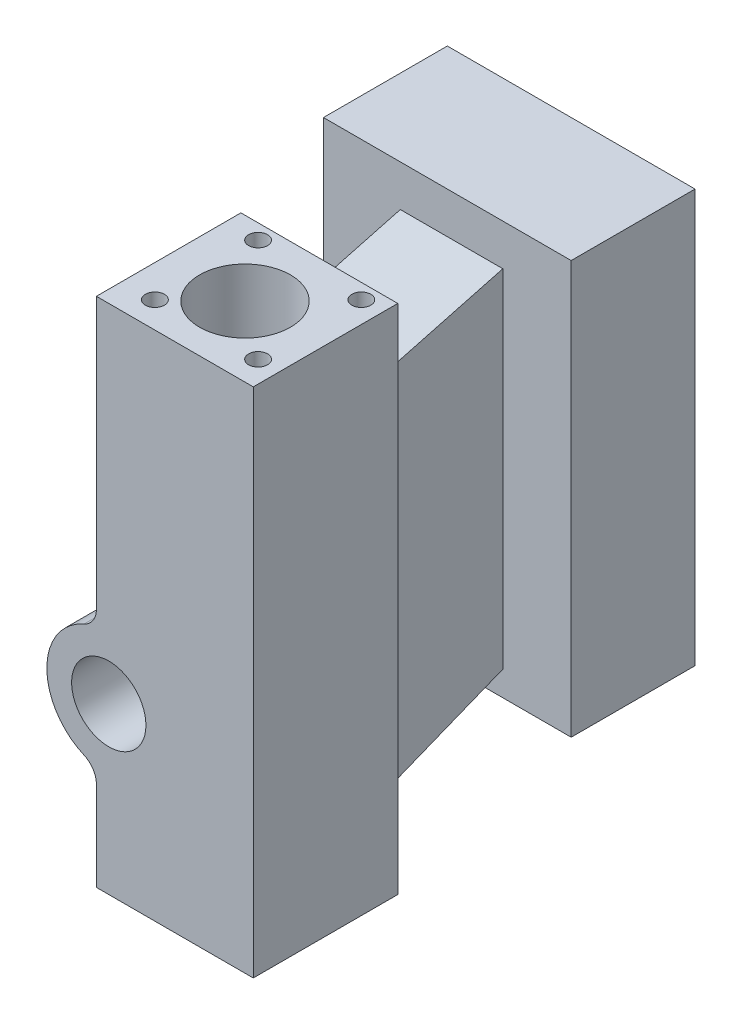
ISO-10303-21;
HEADER;
FILE_DESCRIPTION(('STEP AP214'),'2;1');
FILE_NAME('part.step','',(''),(''),'','','');
FILE_SCHEMA(('AUTOMOTIVE_DESIGN { 1 0 10303 214 1 1 1 1 }'));
ENDSEC;
DATA;
#1=APPLICATION_CONTEXT('core data for automotive mechanical design processes');
#2=APPLICATION_PROTOCOL_DEFINITION('international standard','automotive_design',2000,#1);
#3=PRODUCT_CONTEXT('',#1,'mechanical');
#4=PRODUCT('Part','Part','',(#3));
#5=PRODUCT_RELATED_PRODUCT_CATEGORY('part','',(#4));
#6=PRODUCT_DEFINITION_FORMATION('','',#4);
#7=PRODUCT_DEFINITION_CONTEXT('part definition',#1,'design');
#8=PRODUCT_DEFINITION('design','',#6,#7);
#9=PRODUCT_DEFINITION_SHAPE('','',#8);
#10=(LENGTH_UNIT() NAMED_UNIT(*) SI_UNIT(.MILLI.,.METRE.));
#11=(NAMED_UNIT(*) PLANE_ANGLE_UNIT() SI_UNIT($,.RADIAN.));
#12=(NAMED_UNIT(*) SI_UNIT($,.STERADIAN.) SOLID_ANGLE_UNIT());
#13=UNCERTAINTY_MEASURE_WITH_UNIT(LENGTH_MEASURE(1.E-05),#10,'distance_accuracy_value','');
#14=(GEOMETRIC_REPRESENTATION_CONTEXT(3) GLOBAL_UNCERTAINTY_ASSIGNED_CONTEXT((#13)) GLOBAL_UNIT_ASSIGNED_CONTEXT((#10,
#11,#12)) REPRESENTATION_CONTEXT('',''));
#15=CARTESIAN_POINT('',(0.,0.,0.));
#16=DIRECTION('',(0.,0.,1.));
#17=DIRECTION('',(1.,0.,0.));
#18=AXIS2_PLACEMENT_3D('',#15,#16,#17);
#19=CARTESIAN_POINT('',(0.,0.,0.));
#20=DIRECTION('',(0.,0.,1.));
#21=DIRECTION('',(1.,0.,0.));
#22=AXIS2_PLACEMENT_3D('',#19,#20,#21);
#23=PLANE('',#22);
#24=DIRECTION('',(1.,0.,0.));
#25=VECTOR('',#24,1.);
#26=CARTESIAN_POINT('',(-92.7381953480097,31.309375,0.));
#27=LINE('',#26,#25);
#28=CARTESIAN_POINT('',(-17.5691022526914,31.309375,0.));
#29=VERTEX_POINT('',#28);
#30=CARTESIAN_POINT('',(7.26180465199033,31.309375,0.));
#31=VERTEX_POINT('',#30);
#32=EDGE_CURVE('E349',#29,#31,#27,.T.);
#33=ORIENTED_EDGE('',*,*,#32,.F.);
#34=DIRECTION('',(0.,1.,0.));
#35=VECTOR('',#34,1.);
#36=CARTESIAN_POINT('',(-17.5691022526914,48.6909487492889,0.));
#37=LINE('',#36,#35);
#38=CARTESIAN_POINT('',(-17.5691022526914,-56.690625,0.));
#39=VERTEX_POINT('',#38);
#40=EDGE_CURVE('E273',#39,#29,#37,.T.);
#41=ORIENTED_EDGE('',*,*,#40,.F.);
#42=DIRECTION('',(1.,0.,0.));
#43=VECTOR('',#42,1.);
#44=CARTESIAN_POINT('',(-92.7381953480097,-56.690625,0.));
#45=LINE('',#44,#43);
#46=CARTESIAN_POINT('',(7.26180465199033,-56.690625,0.));
#47=VERTEX_POINT('',#46);
#48=EDGE_CURVE('E338',#39,#47,#45,.T.);
#49=ORIENTED_EDGE('',*,*,#48,.T.);
#50=DIRECTION('',(0.,-1.,0.));
#51=VECTOR('',#50,1.);
#52=CARTESIAN_POINT('',(7.26180465199033,48.6909487492889,0.));
#53=LINE('',#52,#51);
#54=EDGE_CURVE('E278',#31,#47,#53,.T.);
#55=ORIENTED_EDGE('',*,*,#54,.F.);
#56=EDGE_LOOP('',(#33,#41,#49,#55));
#57=FACE_BOUND('',#56,.T.);
#58=DIRECTION('',(0.,-1.,0.));
#59=VECTOR('',#58,1.);
#60=CARTESIAN_POINT('',(-26.18125,49.309375,0.));
#61=LINE('',#60,#59);
#62=CARTESIAN_POINT('',(-26.18125,49.309375,0.));
#63=VERTEX_POINT('',#62);
#64=CARTESIAN_POINT('',(-26.18125,-74.690625,0.));
#65=VERTEX_POINT('',#64);
#66=EDGE_CURVE('E255',#63,#65,#61,.T.);
#67=ORIENTED_EDGE('',*,*,#66,.F.);
#68=DIRECTION('',(-1.,0.,0.));
#69=VECTOR('',#68,1.);
#70=CARTESIAN_POINT('',(-26.18125,49.309375,0.));
#71=LINE('',#70,#69);
#72=CARTESIAN_POINT('',(11.81875,49.309375,0.));
#73=VERTEX_POINT('',#72);
#74=EDGE_CURVE('E245',#73,#63,#71,.T.);
#75=ORIENTED_EDGE('',*,*,#74,.F.);
#76=DIRECTION('',(0.,1.,0.));
#77=VECTOR('',#76,1.);
#78=CARTESIAN_POINT('',(11.81875,49.309375,0.));
#79=LINE('',#78,#77);
#80=CARTESIAN_POINT('',(11.81875,-74.690625,0.));
#81=VERTEX_POINT('',#80);
#82=EDGE_CURVE('E249',#81,#73,#79,.T.);
#83=ORIENTED_EDGE('',*,*,#82,.F.);
#84=DIRECTION('',(1.,0.,0.));
#85=VECTOR('',#84,1.);
#86=CARTESIAN_POINT('',(-26.18125,-74.690625,0.));
#87=LINE('',#86,#85);
#88=EDGE_CURVE('E252',#65,#81,#87,.T.);
#89=ORIENTED_EDGE('',*,*,#88,.F.);
#90=EDGE_LOOP('',(#67,#75,#83,#89));
#91=FACE_BOUND('',#90,.T.);
#92=ADVANCED_FACE('F41',(#57,#91),#23,.F.);
#93=CARTESIAN_POINT('',(-26.18125,49.309375,35.));
#94=DIRECTION('',(1.,0.,0.));
#95=DIRECTION('',(0.,1.,0.));
#96=AXIS2_PLACEMENT_3D('',#93,#94,#95);
#97=PLANE('',#96);
#98=DIRECTION('',(0.,-1.,0.));
#99=VECTOR('',#98,1.);
#100=CARTESIAN_POINT('',(-26.18125,49.309375,35.));
#101=LINE('',#100,#99);
#102=CARTESIAN_POINT('',(-26.18125,-53.0209277798234,35.));
#103=VERTEX_POINT('',#102);
#104=CARTESIAN_POINT('',(-26.18125,-74.690625,35.));
#105=VERTEX_POINT('',#104);
#106=EDGE_CURVE('E248',#103,#105,#101,.T.);
#107=ORIENTED_EDGE('',*,*,#106,.F.);
#108=DIRECTION('',(0.,0.,1.));
#109=VECTOR('',#108,1.);
#110=CARTESIAN_POINT('',(-26.18125,-53.0209277798234,35.));
#111=LINE('',#110,#109);
#112=CARTESIAN_POINT('',(-26.18125,-53.0209277798234,1.));
#113=VERTEX_POINT('',#112);
#114=EDGE_CURVE('E217',#103,#113,#111,.F.);
#115=ORIENTED_EDGE('',*,*,#114,.T.);
#116=DIRECTION('',(0.,-1.,0.));
#117=VECTOR('',#116,1.);
#118=CARTESIAN_POINT('',(-26.18125,49.309375,1.));
#119=LINE('',#118,#117);
#120=CARTESIAN_POINT('',(-26.18125,-16.3603222201766,1.));
#121=VERTEX_POINT('',#120);
#122=EDGE_CURVE('E225',#121,#113,#119,.T.);
#123=ORIENTED_EDGE('',*,*,#122,.F.);
#124=DIRECTION('',(0.,0.,1.));
#125=VECTOR('',#124,1.);
#126=CARTESIAN_POINT('',(-26.18125,-16.3603222201766,35.));
#127=LINE('',#126,#125);
#128=CARTESIAN_POINT('',(-26.18125,-16.3603222201766,35.));
#129=VERTEX_POINT('',#128);
#130=EDGE_CURVE('E221',#121,#129,#127,.T.);
#131=ORIENTED_EDGE('',*,*,#130,.T.);
#132=CARTESIAN_POINT('',(-26.18125,49.309375,35.));
#133=VERTEX_POINT('',#132);
#134=EDGE_CURVE('E266',#133,#129,#101,.T.);
#135=ORIENTED_EDGE('',*,*,#134,.F.);
#136=DIRECTION('',(0.,0.,-1.));
#137=VECTOR('',#136,1.);
#138=CARTESIAN_POINT('',(-26.18125,49.309375,35.));
#139=LINE('',#138,#137);
#140=EDGE_CURVE('E240',#133,#63,#139,.T.);
#141=ORIENTED_EDGE('',*,*,#140,.T.);
#142=ORIENTED_EDGE('',*,*,#66,.T.);
#143=DIRECTION('',(0.,0.,-1.));
#144=VECTOR('',#143,1.);
#145=CARTESIAN_POINT('',(-26.18125,-74.690625,35.));
#146=LINE('',#145,#144);
#147=EDGE_CURVE('E228',#105,#65,#146,.T.);
#148=ORIENTED_EDGE('',*,*,#147,.F.);
#149=EDGE_LOOP('',(#107,#115,#123,#131,#135,#141,#142,#148));
#150=FACE_BOUND('',#149,.T.);
#151=ADVANCED_FACE('F411',(#150),#97,.F.);
#152=CARTESIAN_POINT('',(-26.18125,-74.690625,35.));
#153=DIRECTION('',(0.,1.,0.));
#154=DIRECTION('',(0.,0.,1.));
#155=AXIS2_PLACEMENT_3D('',#152,#153,#154);
#156=PLANE('',#155);
#157=CARTESIAN_POINT('',(-7.18124999999999,-74.690625,18.));
#158=DIRECTION('',(0.,-1.,0.));
#159=DIRECTION('',(0.,0.,-1.));
#160=AXIS2_PLACEMENT_3D('',#157,#158,#159);
#161=CIRCLE('',#160,11.);
#162=CARTESIAN_POINT('',(-7.18124999999999,-74.690625,7.));
#163=VERTEX_POINT('',#162);
#164=EDGE_CURVE('E182',#163,#163,#161,.T.);
#165=ORIENTED_EDGE('',*,*,#164,.F.);
#166=EDGE_LOOP('',(#165));
#167=FACE_BOUND('',#166,.T.);
#168=ORIENTED_EDGE('',*,*,#88,.T.);
#169=DIRECTION('',(0.,0.,-1.));
#170=VECTOR('',#169,1.);
#171=CARTESIAN_POINT('',(11.81875,-74.690625,35.));
#172=LINE('',#171,#170);
#173=CARTESIAN_POINT('',(11.81875,-74.690625,35.));
#174=VERTEX_POINT('',#173);
#175=EDGE_CURVE('E232',#174,#81,#172,.T.);
#176=ORIENTED_EDGE('',*,*,#175,.F.);
#177=DIRECTION('',(1.,0.,0.));
#178=VECTOR('',#177,1.);
#179=CARTESIAN_POINT('',(-26.18125,-74.690625,35.));
#180=LINE('',#179,#178);
#181=EDGE_CURVE('E263',#105,#174,#180,.T.);
#182=ORIENTED_EDGE('',*,*,#181,.F.);
#183=ORIENTED_EDGE('',*,*,#147,.T.);
#184=EDGE_LOOP('',(#168,#176,#182,#183));
#185=FACE_BOUND('',#184,.T.);
#186=ADVANCED_FACE('F432',(#167,#185),#156,.F.);
#187=CARTESIAN_POINT('',(11.81875,49.309375,35.));
#188=DIRECTION('',(-1.,0.,0.));
#189=DIRECTION('',(0.,0.,1.));
#190=AXIS2_PLACEMENT_3D('',#187,#188,#189);
#191=PLANE('',#190);
#192=ORIENTED_EDGE('',*,*,#82,.T.);
#193=DIRECTION('',(0.,0.,-1.));
#194=VECTOR('',#193,1.);
#195=CARTESIAN_POINT('',(11.81875,49.309375,35.));
#196=LINE('',#195,#194);
#197=CARTESIAN_POINT('',(11.81875,49.309375,35.));
#198=VERTEX_POINT('',#197);
#199=EDGE_CURVE('E236',#198,#73,#196,.T.);
#200=ORIENTED_EDGE('',*,*,#199,.F.);
#201=DIRECTION('',(0.,1.,0.));
#202=VECTOR('',#201,1.);
#203=CARTESIAN_POINT('',(11.81875,49.309375,35.));
#204=LINE('',#203,#202);
#205=EDGE_CURVE('E260',#174,#198,#204,.T.);
#206=ORIENTED_EDGE('',*,*,#205,.F.);
#207=ORIENTED_EDGE('',*,*,#175,.T.);
#208=EDGE_LOOP('',(#192,#200,#206,#207));
#209=FACE_BOUND('',#208,.T.);
#210=ADVANCED_FACE('F438',(#209),#191,.F.);
#211=CARTESIAN_POINT('',(-26.18125,49.309375,35.));
#212=DIRECTION('',(0.,-1.,0.));
#213=DIRECTION('',(0.,0.,-1.));
#214=AXIS2_PLACEMENT_3D('',#211,#212,#213);
#215=PLANE('',#214);
#216=CARTESIAN_POINT('',(6.62471597335038,49.309375,3.63901541292802));
#217=DIRECTION('',(0.,1.,0.));
#218=DIRECTION('',(0.,0.,1.));
#219=AXIS2_PLACEMENT_3D('',#216,#217,#218);
#220=CIRCLE('',#219,2.30151664549466);
#221=CARTESIAN_POINT('',(6.62471597335038,49.309375,5.94053205842269));
#222=VERTEX_POINT('',#221);
#223=EDGE_CURVE('E387',#222,#222,#220,.T.);
#224=ORIENTED_EDGE('',*,*,#223,.F.);
#225=EDGE_LOOP('',(#224));
#226=FACE_BOUND('',#225,.T.);
#227=CARTESIAN_POINT('',(-18.3752840266496,49.309375,28.639015412928));
#228=DIRECTION('',(0.,1.,0.));
#229=DIRECTION('',(0.,0.,1.));
#230=AXIS2_PLACEMENT_3D('',#227,#228,#229);
#231=CIRCLE('',#230,2.30151664549466);
#232=CARTESIAN_POINT('',(-18.3752840266496,49.309375,30.9405320584227));
#233=VERTEX_POINT('',#232);
#234=EDGE_CURVE('E379',#233,#233,#231,.T.);
#235=ORIENTED_EDGE('',*,*,#234,.F.);
#236=EDGE_LOOP('',(#235));
#237=FACE_BOUND('',#236,.T.);
#238=CARTESIAN_POINT('',(-18.3752840266496,49.309375,3.63901541292802));
#239=DIRECTION('',(0.,1.,0.));
#240=DIRECTION('',(0.,0.,1.));
#241=AXIS2_PLACEMENT_3D('',#238,#239,#240);
#242=CIRCLE('',#241,2.30151664549466);
#243=CARTESIAN_POINT('',(-18.3752840266496,49.309375,5.94053205842269));
#244=VERTEX_POINT('',#243);
#245=EDGE_CURVE('E172',#244,#244,#242,.T.);
#246=ORIENTED_EDGE('',*,*,#245,.F.);
#247=EDGE_LOOP('',(#246));
#248=FACE_BOUND('',#247,.T.);
#249=CARTESIAN_POINT('',(6.62471597335038,49.309375,28.639015412928));
#250=DIRECTION('',(0.,1.,0.));
#251=DIRECTION('',(0.,0.,1.));
#252=AXIS2_PLACEMENT_3D('',#249,#250,#251);
#253=CIRCLE('',#252,2.30151664549466);
#254=CARTESIAN_POINT('',(6.62471597335038,49.309375,30.9405320584227));
#255=VERTEX_POINT('',#254);
#256=EDGE_CURVE('E364',#255,#255,#253,.T.);
#257=ORIENTED_EDGE('',*,*,#256,.F.);
#258=EDGE_LOOP('',(#257));
#259=FACE_BOUND('',#258,.T.);
#260=CARTESIAN_POINT('',(-7.18124999999999,49.309375,18.));
#261=DIRECTION('',(0.,-1.,0.));
#262=DIRECTION('',(0.,0.,-1.));
#263=AXIS2_PLACEMENT_3D('',#260,#261,#262);
#264=CIRCLE('',#263,11.);
#265=CARTESIAN_POINT('',(-7.18124999999999,49.309375,7.));
#266=VERTEX_POINT('',#265);
#267=EDGE_CURVE('E185',#266,#266,#264,.T.);
#268=ORIENTED_EDGE('',*,*,#267,.T.);
#269=EDGE_LOOP('',(#268));
#270=FACE_BOUND('',#269,.T.);
#271=ORIENTED_EDGE('',*,*,#74,.T.);
#272=ORIENTED_EDGE('',*,*,#140,.F.);
#273=DIRECTION('',(-1.,0.,0.));
#274=VECTOR('',#273,1.);
#275=CARTESIAN_POINT('',(-26.18125,49.309375,35.));
#276=LINE('',#275,#274);
#277=EDGE_CURVE('E244',#198,#133,#276,.T.);
#278=ORIENTED_EDGE('',*,*,#277,.F.);
#279=ORIENTED_EDGE('',*,*,#199,.T.);
#280=EDGE_LOOP('',(#271,#272,#278,#279));
#281=FACE_BOUND('',#280,.T.);
#282=ADVANCED_FACE('F403',(#226,#237,#248,#259,#270,#281),#215,.F.);
#283=CARTESIAN_POINT('',(0.,0.,35.));
#284=DIRECTION('',(0.,0.,1.));
#285=DIRECTION('',(1.,0.,0.));
#286=AXIS2_PLACEMENT_3D('',#283,#284,#285);
#287=PLANE('',#286);
#288=CARTESIAN_POINT('',(-23.18125,-34.690625,35.));
#289=DIRECTION('',(0.,0.,1.));
#290=DIRECTION('',(1.,0.,0.));
#291=AXIS2_PLACEMENT_3D('',#288,#289,#290);
#292=CIRCLE('',#291,9.);
#293=CARTESIAN_POINT('',(-14.18125,-34.690625,35.));
#294=VERTEX_POINT('',#293);
#295=EDGE_CURVE('E173',#294,#294,#292,.T.);
#296=ORIENTED_EDGE('',*,*,#295,.F.);
#297=EDGE_LOOP('',(#296));
#298=FACE_BOUND('',#297,.T.);
#299=ORIENTED_EDGE('',*,*,#134,.T.);
#300=CARTESIAN_POINT('',(-31.18125,-16.3603222201766,35.));
#301=DIRECTION('',(0.,0.,1.));
#302=DIRECTION('',(1.,0.,0.));
#303=AXIS2_PLACEMENT_3D('',#300,#301,#302);
#304=CIRCLE('',#303,5.);
#305=CARTESIAN_POINT('',(-29.18125,-20.9428979151325,35.));
#306=VERTEX_POINT('',#305);
#307=EDGE_CURVE('E202',#129,#306,#304,.F.);
#308=ORIENTED_EDGE('',*,*,#307,.T.);
#309=CARTESIAN_POINT('',(-23.18125,-34.690625,35.));
#310=DIRECTION('',(0.,0.,1.));
#311=DIRECTION('',(1.,0.,0.));
#312=AXIS2_PLACEMENT_3D('',#309,#310,#311);
#313=CIRCLE('',#312,15.);
#314=CARTESIAN_POINT('',(-29.18125,-48.4383520848675,35.));
#315=VERTEX_POINT('',#314);
#316=EDGE_CURVE('E188',#306,#315,#313,.T.);
#317=ORIENTED_EDGE('',*,*,#316,.T.);
#318=CARTESIAN_POINT('',(-31.18125,-53.0209277798234,35.));
#319=DIRECTION('',(0.,0.,1.));
#320=DIRECTION('',(1.,0.,0.));
#321=AXIS2_PLACEMENT_3D('',#318,#319,#320);
#322=CIRCLE('',#321,5.);
#323=EDGE_CURVE('E205',#315,#103,#322,.F.);
#324=ORIENTED_EDGE('',*,*,#323,.T.);
#325=ORIENTED_EDGE('',*,*,#106,.T.);
#326=ORIENTED_EDGE('',*,*,#181,.T.);
#327=ORIENTED_EDGE('',*,*,#205,.T.);
#328=ORIENTED_EDGE('',*,*,#277,.T.);
#329=EDGE_LOOP('',(#299,#308,#317,#324,#325,#326,#327,#328));
#330=FACE_BOUND('',#329,.T.);
#331=ADVANCED_FACE('F399',(#298,#330),#287,.T.);
#332=CARTESIAN_POINT('',(-23.18125,-34.690625,1.));
#333=DIRECTION('',(0.,0.,1.));
#334=DIRECTION('',(1.,0.,0.));
#335=AXIS2_PLACEMENT_3D('',#332,#333,#334);
#336=PLANE('',#335);
#337=CARTESIAN_POINT('',(-23.18125,-34.690625,1.));
#338=DIRECTION('',(0.,0.,1.));
#339=DIRECTION('',(1.,0.,0.));
#340=AXIS2_PLACEMENT_3D('',#337,#338,#339);
#341=CIRCLE('',#340,15.);
#342=CARTESIAN_POINT('',(-29.18125,-20.9428979151325,1.));
#343=VERTEX_POINT('',#342);
#344=CARTESIAN_POINT('',(-29.18125,-48.4383520848675,1.));
#345=VERTEX_POINT('',#344);
#346=EDGE_CURVE('E193',#343,#345,#341,.T.);
#347=ORIENTED_EDGE('',*,*,#346,.F.);
#348=CARTESIAN_POINT('',(-31.18125,-16.3603222201766,1.));
#349=DIRECTION('',(0.,0.,1.));
#350=DIRECTION('',(1.,0.,0.));
#351=AXIS2_PLACEMENT_3D('',#348,#349,#350);
#352=CIRCLE('',#351,5.);
#353=EDGE_CURVE('E198',#343,#121,#352,.T.);
#354=ORIENTED_EDGE('',*,*,#353,.T.);
#355=ORIENTED_EDGE('',*,*,#122,.T.);
#356=CARTESIAN_POINT('',(-31.18125,-53.0209277798234,1.));
#357=DIRECTION('',(0.,0.,1.));
#358=DIRECTION('',(1.,0.,0.));
#359=AXIS2_PLACEMENT_3D('',#356,#357,#358);
#360=CIRCLE('',#359,5.);
#361=EDGE_CURVE('E208',#113,#345,#360,.T.);
#362=ORIENTED_EDGE('',*,*,#361,.T.);
#363=EDGE_LOOP('',(#347,#354,#355,#362));
#364=FACE_BOUND('',#363,.T.);
#365=ADVANCED_FACE('F402',(#364),#336,.F.);
#366=CARTESIAN_POINT('',(-23.18125,-34.690625,1.));
#367=DIRECTION('',(0.,0.,1.));
#368=DIRECTION('',(1.,0.,0.));
#369=AXIS2_PLACEMENT_3D('',#366,#367,#368);
#370=CYLINDRICAL_SURFACE('',#369,15.);
#371=ORIENTED_EDGE('',*,*,#346,.T.);
#372=DIRECTION('',(0.,0.,1.));
#373=VECTOR('',#372,1.);
#374=CARTESIAN_POINT('',(-29.18125,-48.4383520848675,1.));
#375=LINE('',#374,#373);
#376=EDGE_CURVE('E211',#345,#315,#375,.T.);
#377=ORIENTED_EDGE('',*,*,#376,.T.);
#378=ORIENTED_EDGE('',*,*,#316,.F.);
#379=DIRECTION('',(0.,0.,1.));
#380=VECTOR('',#379,1.);
#381=CARTESIAN_POINT('',(-29.18125,-20.9428979151325,1.));
#382=LINE('',#381,#380);
#383=EDGE_CURVE('E214',#306,#343,#382,.F.);
#384=ORIENTED_EDGE('',*,*,#383,.T.);
#385=EDGE_LOOP('',(#371,#377,#378,#384));
#386=FACE_BOUND('',#385,.T.);
#387=ADVANCED_FACE('F419',(#386),#370,.T.);
#388=CARTESIAN_POINT('',(-31.18125,-53.0209277798234,1.));
#389=DIRECTION('',(0.,0.,1.));
#390=DIRECTION('',(1.,0.,0.));
#391=AXIS2_PLACEMENT_3D('',#388,#389,#390);
#392=CYLINDRICAL_SURFACE('',#391,5.);
#393=ORIENTED_EDGE('',*,*,#323,.F.);
#394=ORIENTED_EDGE('',*,*,#376,.F.);
#395=ORIENTED_EDGE('',*,*,#361,.F.);
#396=ORIENTED_EDGE('',*,*,#114,.F.);
#397=EDGE_LOOP('',(#393,#394,#395,#396));
#398=FACE_BOUND('',#397,.T.);
#399=ADVANCED_FACE('F426',(#398),#392,.F.);
#400=CARTESIAN_POINT('',(-31.18125,-16.3603222201766,1.));
#401=DIRECTION('',(0.,0.,1.));
#402=DIRECTION('',(1.,0.,0.));
#403=AXIS2_PLACEMENT_3D('',#400,#401,#402);
#404=CYLINDRICAL_SURFACE('',#403,5.);
#405=ORIENTED_EDGE('',*,*,#353,.F.);
#406=ORIENTED_EDGE('',*,*,#383,.F.);
#407=ORIENTED_EDGE('',*,*,#307,.F.);
#408=ORIENTED_EDGE('',*,*,#130,.F.);
#409=EDGE_LOOP('',(#405,#406,#407,#408));
#410=FACE_BOUND('',#409,.T.);
#411=ADVANCED_FACE('F43',(#410),#404,.F.);
#412=CARTESIAN_POINT('',(-7.18124999999999,925.309375,18.));
#413=DIRECTION('',(0.,-1.,0.));
#414=DIRECTION('',(0.,0.,-1.));
#415=AXIS2_PLACEMENT_3D('',#412,#413,#414);
#416=CYLINDRICAL_SURFACE('',#415,11.);
#417=DIRECTION('',(0.,-1.,0.));
#418=VECTOR('',#417,1.);
#419=CARTESIAN_POINT('',(-18.18125,925.309375,18.));
#420=LINE('',#419,#418);
#421=CARTESIAN_POINT('',(-18.18125,-42.1739397735479,18.));
#422=VERTEX_POINT('',#421);
#423=CARTESIAN_POINT('',(-18.18125,-27.2073102264521,18.));
#424=VERTEX_POINT('',#423);
#425=EDGE_CURVE('E56',#422,#424,#420,.F.);
#426=ORIENTED_EDGE('',*,*,#425,.F.);
#427=CARTESIAN_POINT('',(-18.18125,-42.1739397735479,18.));
#428=CARTESIAN_POINT('',(-18.1812506986015,-42.1739364043247,18.1224798590371));
#429=CARTESIAN_POINT('',(-18.1792039506006,-42.1725732075603,18.2449462679007));
#430=CARTESIAN_POINT('',(-18.1710271681398,-42.1671015707938,18.4896830604016));
#431=CARTESIAN_POINT('',(-18.1648970719768,-42.1629930893082,18.6119534410487));
#432=CARTESIAN_POINT('',(-18.1403982580435,-42.1465107181732,18.97822634366));
#433=CARTESIAN_POINT('',(-18.1159210175816,-42.1299798959348,19.221675481537));
#434=CARTESIAN_POINT('',(-18.050841776926,-42.0852494353983,19.7064852840486));
#435=CARTESIAN_POINT('',(-18.0101641455306,-42.0569950395658,19.9478306487566));
#436=CARTESIAN_POINT('',(-17.9132586172202,-41.9880084510938,20.4255673005737));
#437=CARTESIAN_POINT('',(-17.8570318622359,-41.9472771747353,20.6619589501138));
#438=CARTESIAN_POINT('',(-17.7297243346768,-41.8521330937214,21.1286324957773));
#439=CARTESIAN_POINT('',(-17.6586031843799,-41.7976830150952,21.3588958256013));
#440=CARTESIAN_POINT('',(-17.5028552229484,-41.6738710000895,21.8107156819696));
#441=CARTESIAN_POINT('',(-17.4182280049387,-41.6045086144494,22.0322719459597));
#442=CARTESIAN_POINT('',(-17.2373913856752,-41.4496688886427,22.4641570510437));
#443=CARTESIAN_POINT('',(-17.1412082863745,-41.3642279023242,22.6745098727483));
#444=CARTESIAN_POINT('',(-16.9393538337212,-41.1758215085777,23.0824377151739));
#445=CARTESIAN_POINT('',(-16.8336836722432,-41.0728583010425,23.280014335639));
#446=CARTESIAN_POINT('',(-16.6239643898392,-40.8568952281534,23.6458995935318));
#447=CARTESIAN_POINT('',(-16.5204042152415,-40.7452560550955,23.8152912972508));
#448=CARTESIAN_POINT('',(-16.3101935241447,-40.5056030883655,24.1400157205915));
#449=CARTESIAN_POINT('',(-16.2035431424594,-40.3775900081944,24.2953490523102));
#450=CARTESIAN_POINT('',(-15.9901200296433,-40.1051942535036,24.5906751570075));
#451=CARTESIAN_POINT('',(-15.8833473858177,-39.9608197574149,24.7306755261135));
#452=CARTESIAN_POINT('',(-15.6727036469236,-39.6561065270827,24.9945495323188));
#453=CARTESIAN_POINT('',(-15.5688321838721,-39.4957698293528,25.1184252220194));
#454=CARTESIAN_POINT('',(-15.3803654234737,-39.1822953506115,25.3343207498921));
#455=CARTESIAN_POINT('',(-15.2950357492867,-39.0310019706238,25.4283871274128));
#456=CARTESIAN_POINT('',(-15.130720791219,-38.7180558611037,25.6039709482515));
#457=CARTESIAN_POINT('',(-15.0517348964801,-38.5564041317035,25.6854896005152));
#458=CARTESIAN_POINT('',(-14.9017835681919,-38.2238542460231,25.836112869441));
#459=CARTESIAN_POINT('',(-14.8308185738638,-38.0529555841417,25.9052168064005));
#460=CARTESIAN_POINT('',(-14.6983609179581,-37.7031921145686,26.0312769484373));
#461=CARTESIAN_POINT('',(-14.6368683069452,-37.5243272643589,26.0882330886689));
#462=CARTESIAN_POINT('',(-14.5268143971213,-37.1673598246839,26.1882837315232));
#463=CARTESIAN_POINT('',(-14.4778316391461,-36.9895173458749,26.2318445850532));
#464=CARTESIAN_POINT('',(-14.3905154525214,-36.6290211762794,26.3084214392102));
#465=CARTESIAN_POINT('',(-14.3521816416491,-36.4463676584335,26.3414378183167));
#466=CARTESIAN_POINT('',(-14.2867772351565,-36.0775070500731,26.3972216859052));
#467=CARTESIAN_POINT('',(-14.2597071813809,-35.8912997890559,26.4199886813433));
#468=CARTESIAN_POINT('',(-14.2172496831342,-35.5166092224279,26.4554996795944));
#469=CARTESIAN_POINT('',(-14.2018625401564,-35.3281258582068,26.4682434237441));
#470=CARTESIAN_POINT('',(-14.1828054690151,-34.9461933194525,26.4840072970008));
#471=CARTESIAN_POINT('',(-14.1793878311338,-34.7527228515258,26.4868180723491));
#472=CARTESIAN_POINT('',(-14.1850254750878,-34.3660859869477,26.4821660977565));
#473=CARTESIAN_POINT('',(-14.1940809019432,-34.172919593858,26.4747032283673));
#474=CARTESIAN_POINT('',(-14.2245256597734,-33.7882289035702,26.4494176742743));
#475=CARTESIAN_POINT('',(-14.2459158303697,-33.5967047190575,26.4315942843331));
#476=CARTESIAN_POINT('',(-14.300692371015,-33.2166668920691,26.3853933927703));
#477=CARTESIAN_POINT('',(-14.3340787222334,-33.0281532448681,26.3570159077157));
#478=CARTESIAN_POINT('',(-14.4125799206903,-32.6541597335332,26.2891842666575));
#479=CARTESIAN_POINT('',(-14.4577767816589,-32.4687111278791,26.2496524942789));
#480=CARTESIAN_POINT('',(-14.558995571881,-32.1036167044388,26.159256725709));
#481=CARTESIAN_POINT('',(-14.6150175354547,-31.923970905052,26.1083926935895));
#482=CARTESIAN_POINT('',(-14.736836196298,-31.5718807617436,25.9950005733072));
#483=CARTESIAN_POINT('',(-14.8026298677184,-31.3994342096473,25.9324760943224));
#484=CARTESIAN_POINT('',(-14.9427264557856,-31.0629621255557,25.7954522923056));
#485=CARTESIAN_POINT('',(-15.0170291568532,-30.8989363803686,25.7209532726337));
#486=CARTESIAN_POINT('',(-15.1710441853367,-30.5837102519214,25.5614298506296));
#487=CARTESIAN_POINT('',(-15.2506153835243,-30.4323166005309,25.4766509302215));
#488=CARTESIAN_POINT('',(-15.4148608327142,-30.1396516845565,25.2953823251198));
#489=CARTESIAN_POINT('',(-15.4995349844708,-29.9983802232267,25.1988928681435));
#490=CARTESIAN_POINT('',(-15.6722313277923,-29.726700244948,24.9943648990359));
#491=CARTESIAN_POINT('',(-15.7602530901729,-29.5962903422733,24.8863278641813));
#492=CARTESIAN_POINT('',(-15.9378446827229,-29.3467937592537,24.6590421883181));
#493=CARTESIAN_POINT('',(-16.0274145249011,-29.2277071667926,24.5397934603062));
#494=CARTESIAN_POINT('',(-16.2061645687658,-29.0012518555617,24.2908157261268));
#495=CARTESIAN_POINT('',(-16.2953451555223,-28.893865624082,24.1611029032286));
#496=CARTESIAN_POINT('',(-16.4717431636031,-28.6905720424782,23.8917444285983));
#497=CARTESIAN_POINT('',(-16.5589605912921,-28.594664655135,23.7520988090747));
#498=CARTESIAN_POINT('',(-16.7298817711456,-28.4140562590788,23.4636742262679));
#499=CARTESIAN_POINT('',(-16.813584845922,-28.3293574040914,23.314893515689));
#500=CARTESIAN_POINT('',(-16.9760758983979,-28.1707547171116,23.0091282498306));
#501=CARTESIAN_POINT('',(-17.0548636558765,-28.0968513685918,22.8521433275558));
#502=CARTESIAN_POINT('',(-17.2123957736155,-27.9537863582217,22.5180622512513));
#503=CARTESIAN_POINT('',(-17.2906325434569,-27.8854768516386,22.3403618535127));
#504=CARTESIAN_POINT('',(-17.4387526256834,-27.7600300183219,21.9776901124417));
#505=CARTESIAN_POINT('',(-17.5086354125033,-27.7028933943523,21.7927183126233));
#506=CARTESIAN_POINT('',(-17.6391244525208,-27.5989530772792,21.4165099664933));
#507=CARTESIAN_POINT('',(-17.6997222572302,-27.5521587778232,21.2252679046121));
#508=CARTESIAN_POINT('',(-17.8108102309622,-27.4682137724304,20.8377941830714));
#509=CARTESIAN_POINT('',(-17.861299811075,-27.4310636283291,20.6415622334491));
#510=CARTESIAN_POINT('',(-17.9517161607931,-27.3656607784052,20.2446801695225));
#511=CARTESIAN_POINT('',(-17.9916153020802,-27.3374313090085,20.0440199499092));
#512=CARTESIAN_POINT('',(-18.0602713553861,-27.2894548450028,19.6397968783484));
#513=CARTESIAN_POINT('',(-18.0890278161221,-27.2697081939478,19.4362339091845));
#514=CARTESIAN_POINT('',(-18.1350626122585,-27.2383225461031,19.0276784870494));
#515=CARTESIAN_POINT('',(-18.1523673749997,-27.2266648791422,18.8226904362788));
#516=CARTESIAN_POINT('',(-18.1754697102279,-27.2111738558932,18.4118000265114));
#517=CARTESIAN_POINT('',(-18.1812688699207,-27.2073394203828,18.2058977975543));
#518=CARTESIAN_POINT('',(-18.18125,-27.2073102264521,18.));
#519=B_SPLINE_CURVE_WITH_KNOTS('',3,(#427,#428,#429,#430,#431,#432,#433,#434,#435,#436,#437,
#438,#439,#440,#441,#442,#443,#444,#445,#446,#447,#448,#449,#450,#451,#452,#453,#454,#455,#456,
#457,#458,#459,#460,#461,#462,#463,#464,#465,#466,#467,#468,#469,#470,#471,#472,#473,#474,#475,
#476,#477,#478,#479,#480,#481,#482,#483,#484,#485,#486,#487,#488,#489,#490,#491,#492,#493,#494,
#495,#496,#497,#498,#499,#500,#501,#502,#503,#504,#505,#506,#507,#508,#509,#510,#511,#512,#513,
#514,#515,#516,#517,#518),.UNSPECIFIED.,.F.,.F.,(4,2,2,2,2,2,2,2,2,2,2,2,2,2,2,2,2,2,2,2,2,2,2,
2,2,2,2,2,2,2,2,2,2,2,2,2,2,2,2,2,2,2,2,2,2,4),(0.,0.367387865426625,0.734781282530552,
1.46961341812703,2.20791708915194,2.94616655340197,3.68644388860219,4.4267435291361,
5.16538903067794,5.90394186453074,6.5862729865422,7.26857438576624,7.9505362211867,
8.63241116076783,9.22426014369187,9.81605206752715,10.4078763819547,10.9997038554987,
11.5676660732255,12.135607902436,12.7035770494132,13.2715608531078,13.8514467282948,
14.431339345678,15.011271440796,15.591202625584,16.1752731939746,16.7593456141542,
17.3432375495581,17.9271146951198,18.4990910521764,19.07105628865,19.6429484412395,
20.2148450321037,20.7858735145701,21.3569001454789,21.9280363406452,22.4991981060863,
23.116047258306,23.7329351972942,24.3503811567521,24.9678630784234,25.5869403961852,
26.2060427841973,26.8237114266841,27.4412948554336),.UNSPECIFIED.);
#520=EDGE_CURVE('E11',#422,#424,#519,.T.);
#521=ORIENTED_EDGE('',*,*,#520,.T.);
#522=EDGE_LOOP('',(#426,#521));
#523=FACE_BOUND('',#522,.T.);
#524=ORIENTED_EDGE('',*,*,#164,.T.);
#525=EDGE_LOOP('',(#524));
#526=FACE_BOUND('',#525,.T.);
#527=ORIENTED_EDGE('',*,*,#267,.F.);
#528=EDGE_LOOP('',(#527));
#529=FACE_BOUND('',#528,.T.);
#530=ADVANCED_FACE('F175',(#523,#526,#529),#416,.F.);
#531=CARTESIAN_POINT('',(7.26180465199033,48.6909487492889,-30.));
#532=DIRECTION('',(-1.,0.,0.));
#533=DIRECTION('',(0.,0.,1.));
#534=AXIS2_PLACEMENT_3D('',#531,#532,#533);
#535=PLANE('',#534);
#536=DIRECTION('',(0.,-1.,0.));
#537=VECTOR('',#536,1.);
#538=CARTESIAN_POINT('',(7.26180465199033,48.6909487492889,-30.));
#539=LINE('',#538,#537);
#540=CARTESIAN_POINT('',(7.26180465199033,39.309375,-30.));
#541=VERTEX_POINT('',#540);
#542=CARTESIAN_POINT('',(7.26180465199033,-44.690625,-30.));
#543=VERTEX_POINT('',#542);
#544=EDGE_CURVE('E277',#541,#543,#539,.T.);
#545=ORIENTED_EDGE('',*,*,#544,.F.);
#546=DIRECTION('',(0.,0.257662650560332,-0.966234939601246));
#547=VECTOR('',#546,1.);
#548=CARTESIAN_POINT('',(7.26180465199033,31.309375,0.));
#549=LINE('',#548,#547);
#550=EDGE_CURVE('E70',#31,#541,#549,.T.);
#551=ORIENTED_EDGE('',*,*,#550,.F.);
#552=ORIENTED_EDGE('',*,*,#54,.T.);
#553=DIRECTION('',(0.,-0.371390676354103,0.928476690885259));
#554=VECTOR('',#553,1.);
#555=CARTESIAN_POINT('',(7.26180465199033,-44.690625,-30.));
#556=LINE('',#555,#554);
#557=EDGE_CURVE('E342',#543,#47,#556,.T.);
#558=ORIENTED_EDGE('',*,*,#557,.F.);
#559=EDGE_LOOP('',(#545,#551,#552,#558));
#560=FACE_BOUND('',#559,.T.);
#561=ADVANCED_FACE('F178',(#560),#535,.F.);
#562=CARTESIAN_POINT('',(-17.5691022526914,48.6909487492889,-30.));
#563=DIRECTION('',(1.,0.,0.));
#564=DIRECTION('',(0.,0.,-1.));
#565=AXIS2_PLACEMENT_3D('',#562,#563,#564);
#566=PLANE('',#565);
#567=ORIENTED_EDGE('',*,*,#40,.T.);
#568=DIRECTION('',(0.,0.257662650560332,-0.966234939601246));
#569=VECTOR('',#568,1.);
#570=CARTESIAN_POINT('',(-17.5691022526914,39.9322180704922,-32.3356615143458));
#571=LINE('',#570,#569);
#572=CARTESIAN_POINT('',(-17.5691022526914,39.309375,-30.));
#573=VERTEX_POINT('',#572);
#574=EDGE_CURVE('E318',#29,#573,#571,.T.);
#575=ORIENTED_EDGE('',*,*,#574,.T.);
#576=DIRECTION('',(0.,1.,0.));
#577=VECTOR('',#576,1.);
#578=CARTESIAN_POINT('',(-17.5691022526914,48.6909487492889,-30.));
#579=LINE('',#578,#577);
#580=CARTESIAN_POINT('',(-17.5691022526914,-44.690625,-30.));
#581=VERTEX_POINT('',#580);
#582=EDGE_CURVE('E195',#581,#573,#579,.T.);
#583=ORIENTED_EDGE('',*,*,#582,.F.);
#584=DIRECTION('',(0.,-0.371390676354103,0.92847669088526));
#585=VECTOR('',#584,1.);
#586=CARTESIAN_POINT('',(-17.5691022526914,-31.8104079311326,-62.2005426721685));
#587=LINE('',#586,#585);
#588=EDGE_CURVE('E333',#581,#39,#587,.T.);
#589=ORIENTED_EDGE('',*,*,#588,.T.);
#590=EDGE_LOOP('',(#567,#575,#583,#589));
#591=FACE_BOUND('',#590,.T.);
#592=ADVANCED_FACE('F472',(#591),#566,.F.);
#593=CARTESIAN_POINT('',(0.,0.,-30.));
#594=DIRECTION('',(0.,0.,-1.));
#595=DIRECTION('',(-1.,0.,0.));
#596=AXIS2_PLACEMENT_3D('',#593,#594,#595);
#597=PLANE('',#596);
#598=DIRECTION('',(1.,0.,0.));
#599=VECTOR('',#598,1.);
#600=CARTESIAN_POINT('',(-92.7381953480097,-44.690625,-30.));
#601=LINE('',#600,#599);
#602=EDGE_CURVE('E341',#581,#543,#601,.T.);
#603=ORIENTED_EDGE('',*,*,#602,.F.);
#604=ORIENTED_EDGE('',*,*,#582,.T.);
#605=DIRECTION('',(1.,0.,0.));
#606=VECTOR('',#605,1.);
#607=CARTESIAN_POINT('',(-92.7381953480097,39.309375,-30.));
#608=LINE('',#607,#606);
#609=EDGE_CURVE('E337',#573,#541,#608,.T.);
#610=ORIENTED_EDGE('',*,*,#609,.T.);
#611=ORIENTED_EDGE('',*,*,#544,.T.);
#612=EDGE_LOOP('',(#603,#604,#610,#611));
#613=FACE_BOUND('',#612,.T.);
#614=DIRECTION('',(0.,-1.,0.));
#615=VECTOR('',#614,1.);
#616=CARTESIAN_POINT('',(23.81875,49.309375,-30.));
#617=LINE('',#616,#615);
#618=CARTESIAN_POINT('',(23.81875,49.309375,-30.));
#619=VERTEX_POINT('',#618);
#620=CARTESIAN_POINT('',(23.81875,-50.690625,-30.));
#621=VERTEX_POINT('',#620);
#622=EDGE_CURVE('E312',#619,#621,#617,.T.);
#623=ORIENTED_EDGE('',*,*,#622,.F.);
#624=DIRECTION('',(1.,0.,0.));
#625=VECTOR('',#624,1.);
#626=CARTESIAN_POINT('',(23.81875,49.309375,-30.));
#627=LINE('',#626,#625);
#628=CARTESIAN_POINT('',(-36.18125,49.309375,-30.));
#629=VERTEX_POINT('',#628);
#630=EDGE_CURVE('E305',#629,#619,#627,.T.);
#631=ORIENTED_EDGE('',*,*,#630,.F.);
#632=DIRECTION('',(0.,1.,0.));
#633=VECTOR('',#632,1.);
#634=CARTESIAN_POINT('',(-36.18125,49.309375,-30.));
#635=LINE('',#634,#633);
#636=CARTESIAN_POINT('',(-36.18125,-50.690625,-30.));
#637=VERTEX_POINT('',#636);
#638=EDGE_CURVE('E309',#637,#629,#635,.T.);
#639=ORIENTED_EDGE('',*,*,#638,.F.);
#640=DIRECTION('',(-1.,0.,0.));
#641=VECTOR('',#640,1.);
#642=CARTESIAN_POINT('',(23.81875,-50.690625,-30.));
#643=LINE('',#642,#641);
#644=EDGE_CURVE('E168',#621,#637,#643,.T.);
#645=ORIENTED_EDGE('',*,*,#644,.F.);
#646=EDGE_LOOP('',(#623,#631,#639,#645));
#647=FACE_BOUND('',#646,.T.);
#648=ADVANCED_FACE('F476',(#613,#647),#597,.F.);
#649=CARTESIAN_POINT('',(23.81875,49.309375,-60.));
#650=DIRECTION('',(-1.,0.,0.));
#651=DIRECTION('',(0.,-1.,0.));
#652=AXIS2_PLACEMENT_3D('',#649,#650,#651);
#653=PLANE('',#652);
#654=ORIENTED_EDGE('',*,*,#622,.T.);
#655=DIRECTION('',(0.,0.,1.));
#656=VECTOR('',#655,1.);
#657=CARTESIAN_POINT('',(23.81875,-50.690625,-60.));
#658=LINE('',#657,#656);
#659=CARTESIAN_POINT('',(23.81875,-50.690625,-60.));
#660=VERTEX_POINT('',#659);
#661=EDGE_CURVE('E282',#660,#621,#658,.T.);
#662=ORIENTED_EDGE('',*,*,#661,.F.);
#663=DIRECTION('',(0.,-1.,0.));
#664=VECTOR('',#663,1.);
#665=CARTESIAN_POINT('',(23.81875,49.309375,-60.));
#666=LINE('',#665,#664);
#667=CARTESIAN_POINT('',(23.81875,49.309375,-60.));
#668=VERTEX_POINT('',#667);
#669=EDGE_CURVE('E308',#668,#660,#666,.T.);
#670=ORIENTED_EDGE('',*,*,#669,.F.);
#671=DIRECTION('',(0.,0.,1.));
#672=VECTOR('',#671,1.);
#673=CARTESIAN_POINT('',(23.81875,49.309375,-60.));
#674=LINE('',#673,#672);
#675=EDGE_CURVE('E300',#668,#619,#674,.T.);
#676=ORIENTED_EDGE('',*,*,#675,.T.);
#677=EDGE_LOOP('',(#654,#662,#670,#676));
#678=FACE_BOUND('',#677,.T.);
#679=ADVANCED_FACE('F478',(#678),#653,.F.);
#680=CARTESIAN_POINT('',(23.81875,-50.690625,-60.));
#681=DIRECTION('',(0.,1.,0.));
#682=DIRECTION('',(-1.,0.,0.));
#683=AXIS2_PLACEMENT_3D('',#680,#681,#682);
#684=PLANE('',#683);
#685=ORIENTED_EDGE('',*,*,#661,.T.);
#686=ORIENTED_EDGE('',*,*,#644,.T.);
#687=DIRECTION('',(0.,0.,1.));
#688=VECTOR('',#687,1.);
#689=CARTESIAN_POINT('',(-36.18125,-50.690625,-60.));
#690=LINE('',#689,#688);
#691=CARTESIAN_POINT('',(-36.18125,-50.690625,-60.));
#692=VERTEX_POINT('',#691);
#693=EDGE_CURVE('E292',#692,#637,#690,.T.);
#694=ORIENTED_EDGE('',*,*,#693,.F.);
#695=DIRECTION('',(-1.,0.,0.));
#696=VECTOR('',#695,1.);
#697=CARTESIAN_POINT('',(23.81875,-50.690625,-60.));
#698=LINE('',#697,#696);
#699=EDGE_CURVE('E324',#660,#692,#698,.T.);
#700=ORIENTED_EDGE('',*,*,#699,.F.);
#701=EDGE_LOOP('',(#685,#686,#694,#700));
#702=FACE_BOUND('',#701,.T.);
#703=ADVANCED_FACE('F481',(#702),#684,.F.);
#704=CARTESIAN_POINT('',(-36.18125,49.309375,-60.));
#705=DIRECTION('',(1.,0.,0.));
#706=DIRECTION('',(0.,1.,0.));
#707=AXIS2_PLACEMENT_3D('',#704,#705,#706);
#708=PLANE('',#707);
#709=CARTESIAN_POINT('',(-36.18125,-15.690625,-45.));
#710=DIRECTION('',(-1.,0.,0.));
#711=DIRECTION('',(0.,0.,1.));
#712=AXIS2_PLACEMENT_3D('',#709,#710,#711);
#713=CIRCLE('',#712,7.5);
#714=CARTESIAN_POINT('',(-36.18125,-15.690625,-37.5));
#715=VERTEX_POINT('',#714);
#716=EDGE_CURVE('E356',#715,#715,#713,.T.);
#717=ORIENTED_EDGE('',*,*,#716,.F.);
#718=EDGE_LOOP('',(#717));
#719=FACE_BOUND('',#718,.T.);
#720=ORIENTED_EDGE('',*,*,#638,.T.);
#721=DIRECTION('',(0.,0.,1.));
#722=VECTOR('',#721,1.);
#723=CARTESIAN_POINT('',(-36.18125,49.309375,-60.));
#724=LINE('',#723,#722);
#725=CARTESIAN_POINT('',(-36.18125,49.309375,-60.));
#726=VERTEX_POINT('',#725);
#727=EDGE_CURVE('E296',#726,#629,#724,.T.);
#728=ORIENTED_EDGE('',*,*,#727,.F.);
#729=DIRECTION('',(0.,1.,0.));
#730=VECTOR('',#729,1.);
#731=CARTESIAN_POINT('',(-36.18125,49.309375,-60.));
#732=LINE('',#731,#730);
#733=EDGE_CURVE('E321',#692,#726,#732,.T.);
#734=ORIENTED_EDGE('',*,*,#733,.F.);
#735=ORIENTED_EDGE('',*,*,#693,.T.);
#736=EDGE_LOOP('',(#720,#728,#734,#735));
#737=FACE_BOUND('',#736,.T.);
#738=ADVANCED_FACE('F485',(#719,#737),#708,.F.);
#739=CARTESIAN_POINT('',(23.81875,49.309375,-60.));
#740=DIRECTION('',(0.,-1.,0.));
#741=DIRECTION('',(0.,0.,-1.));
#742=AXIS2_PLACEMENT_3D('',#739,#740,#741);
#743=PLANE('',#742);
#744=ORIENTED_EDGE('',*,*,#630,.T.);
#745=ORIENTED_EDGE('',*,*,#675,.F.);
#746=DIRECTION('',(1.,0.,0.));
#747=VECTOR('',#746,1.);
#748=CARTESIAN_POINT('',(23.81875,49.309375,-60.));
#749=LINE('',#748,#747);
#750=EDGE_CURVE('E304',#726,#668,#749,.T.);
#751=ORIENTED_EDGE('',*,*,#750,.F.);
#752=ORIENTED_EDGE('',*,*,#727,.T.);
#753=EDGE_LOOP('',(#744,#745,#751,#752));
#754=FACE_BOUND('',#753,.T.);
#755=ADVANCED_FACE('F489',(#754),#743,.F.);
#756=CARTESIAN_POINT('',(0.,0.,-60.));
#757=DIRECTION('',(0.,0.,-1.));
#758=DIRECTION('',(-1.,0.,0.));
#759=AXIS2_PLACEMENT_3D('',#756,#757,#758);
#760=PLANE('',#759);
#761=ORIENTED_EDGE('',*,*,#669,.T.);
#762=ORIENTED_EDGE('',*,*,#699,.T.);
#763=ORIENTED_EDGE('',*,*,#733,.T.);
#764=ORIENTED_EDGE('',*,*,#750,.T.);
#765=EDGE_LOOP('',(#761,#762,#763,#764));
#766=FACE_BOUND('',#765,.T.);
#767=ADVANCED_FACE('F493',(#766),#760,.T.);
#768=CARTESIAN_POINT('',(-92.7381953480097,-44.690625,-30.));
#769=DIRECTION('',(0.,0.928476690885259,0.371390676354103));
#770=DIRECTION('',(0.,-0.371390676354103,0.92847669088526));
#771=AXIS2_PLACEMENT_3D('',#768,#769,#770);
#772=PLANE('',#771);
#773=ORIENTED_EDGE('',*,*,#602,.T.);
#774=ORIENTED_EDGE('',*,*,#557,.T.);
#775=ORIENTED_EDGE('',*,*,#48,.F.);
#776=ORIENTED_EDGE('',*,*,#588,.F.);
#777=EDGE_LOOP('',(#773,#774,#775,#776));
#778=FACE_BOUND('',#777,.T.);
#779=ADVANCED_FACE('F500',(#778),#772,.F.);
#780=CARTESIAN_POINT('',(-92.7381953480097,31.309375,0.));
#781=DIRECTION('',(0.,-0.966234939601246,-0.257662650560332));
#782=DIRECTION('',(0.,0.257662650560332,-0.966234939601246));
#783=AXIS2_PLACEMENT_3D('',#780,#781,#782);
#784=PLANE('',#783);
#785=ORIENTED_EDGE('',*,*,#32,.T.);
#786=ORIENTED_EDGE('',*,*,#550,.T.);
#787=ORIENTED_EDGE('',*,*,#609,.F.);
#788=ORIENTED_EDGE('',*,*,#574,.F.);
#789=EDGE_LOOP('',(#785,#786,#787,#788));
#790=FACE_BOUND('',#789,.T.);
#791=ADVANCED_FACE('F504',(#790),#784,.F.);
#792=CARTESIAN_POINT('',(-26.18125,-15.690625,-45.));
#793=DIRECTION('',(-1.,0.,0.));
#794=DIRECTION('',(0.,0.,1.));
#795=AXIS2_PLACEMENT_3D('',#792,#793,#794);
#796=CYLINDRICAL_SURFACE('',#795,7.5);
#797=CARTESIAN_POINT('',(-26.18125,-15.690625,-45.));
#798=DIRECTION('',(-1.,0.,0.));
#799=DIRECTION('',(0.,0.,1.));
#800=AXIS2_PLACEMENT_3D('',#797,#798,#799);
#801=CIRCLE('',#800,7.5);
#802=CARTESIAN_POINT('',(-26.18125,-15.690625,-37.5));
#803=VERTEX_POINT('',#802);
#804=EDGE_CURVE('E348',#803,#803,#801,.T.);
#805=ORIENTED_EDGE('',*,*,#804,.F.);
#806=EDGE_LOOP('',(#805));
#807=FACE_BOUND('',#806,.T.);
#808=ORIENTED_EDGE('',*,*,#716,.T.);
#809=EDGE_LOOP('',(#808));
#810=FACE_BOUND('',#809,.T.);
#811=ADVANCED_FACE('F508',(#807,#810),#796,.F.);
#812=CARTESIAN_POINT('',(-26.18125,-15.690625,-45.));
#813=DIRECTION('',(-1.,0.,0.));
#814=DIRECTION('',(0.,0.,1.));
#815=AXIS2_PLACEMENT_3D('',#812,#813,#814);
#816=PLANE('',#815);
#817=ORIENTED_EDGE('',*,*,#804,.T.);
#818=EDGE_LOOP('',(#817));
#819=FACE_BOUND('',#818,.T.);
#820=ADVANCED_FACE('F511',(#819),#816,.T.);
#821=CARTESIAN_POINT('',(6.62471597335038,39.309375,28.639015412928));
#822=DIRECTION('',(0.,1.,0.));
#823=DIRECTION('',(0.,0.,1.));
#824=AXIS2_PLACEMENT_3D('',#821,#822,#823);
#825=CYLINDRICAL_SURFACE('',#824,2.30151664549466);
#826=CARTESIAN_POINT('',(6.62471597335038,39.309375,28.639015412928));
#827=DIRECTION('',(0.,1.,0.));
#828=DIRECTION('',(0.,0.,1.));
#829=AXIS2_PLACEMENT_3D('',#826,#827,#828);
#830=CIRCLE('',#829,2.30151664549466);
#831=CARTESIAN_POINT('',(6.62471597335038,39.309375,30.9405320584227));
#832=VERTEX_POINT('',#831);
#833=EDGE_CURVE('E360',#832,#832,#830,.T.);
#834=ORIENTED_EDGE('',*,*,#833,.F.);
#835=EDGE_LOOP('',(#834));
#836=FACE_BOUND('',#835,.T.);
#837=ORIENTED_EDGE('',*,*,#256,.T.);
#838=EDGE_LOOP('',(#837));
#839=FACE_BOUND('',#838,.T.);
#840=ADVANCED_FACE('F515',(#836,#839),#825,.F.);
#841=CARTESIAN_POINT('',(6.62471597335038,39.309375,28.639015412928));
#842=DIRECTION('',(0.,1.,0.));
#843=DIRECTION('',(0.,0.,1.));
#844=AXIS2_PLACEMENT_3D('',#841,#842,#843);
#845=PLANE('',#844);
#846=ORIENTED_EDGE('',*,*,#833,.T.);
#847=EDGE_LOOP('',(#846));
#848=FACE_BOUND('',#847,.T.);
#849=ADVANCED_FACE('F519',(#848),#845,.T.);
#850=CARTESIAN_POINT('',(-18.3752840266496,39.309375,3.63901541292802));
#851=DIRECTION('',(0.,1.,0.));
#852=DIRECTION('',(0.,0.,1.));
#853=AXIS2_PLACEMENT_3D('',#850,#851,#852);
#854=CYLINDRICAL_SURFACE('',#853,2.30151664549466);
#855=CARTESIAN_POINT('',(-18.3752840266496,39.309375,3.63901541292802));
#856=DIRECTION('',(0.,1.,0.));
#857=DIRECTION('',(0.,0.,1.));
#858=AXIS2_PLACEMENT_3D('',#855,#856,#857);
#859=CIRCLE('',#858,2.30151664549466);
#860=CARTESIAN_POINT('',(-18.3752840266496,39.309375,5.94053205842269));
#861=VERTEX_POINT('',#860);
#862=EDGE_CURVE('E375',#861,#861,#859,.T.);
#863=ORIENTED_EDGE('',*,*,#862,.F.);
#864=EDGE_LOOP('',(#863));
#865=FACE_BOUND('',#864,.T.);
#866=ORIENTED_EDGE('',*,*,#245,.T.);
#867=EDGE_LOOP('',(#866));
#868=FACE_BOUND('',#867,.T.);
#869=ADVANCED_FACE('F523',(#865,#868),#854,.F.);
#870=CARTESIAN_POINT('',(-18.3752840266496,39.309375,3.63901541292802));
#871=DIRECTION('',(0.,1.,0.));
#872=DIRECTION('',(0.,0.,1.));
#873=AXIS2_PLACEMENT_3D('',#870,#871,#872);
#874=PLANE('',#873);
#875=ORIENTED_EDGE('',*,*,#862,.T.);
#876=EDGE_LOOP('',(#875));
#877=FACE_BOUND('',#876,.T.);
#878=ADVANCED_FACE('F527',(#877),#874,.T.);
#879=CARTESIAN_POINT('',(-18.3752840266496,39.309375,28.639015412928));
#880=DIRECTION('',(0.,1.,0.));
#881=DIRECTION('',(0.,0.,1.));
#882=AXIS2_PLACEMENT_3D('',#879,#880,#881);
#883=CYLINDRICAL_SURFACE('',#882,2.30151664549466);
#884=CARTESIAN_POINT('',(-18.3752840266496,39.309375,28.639015412928));
#885=DIRECTION('',(0.,1.,0.));
#886=DIRECTION('',(0.,0.,1.));
#887=AXIS2_PLACEMENT_3D('',#884,#885,#886);
#888=CIRCLE('',#887,2.30151664549466);
#889=CARTESIAN_POINT('',(-18.3752840266496,39.309375,30.9405320584227));
#890=VERTEX_POINT('',#889);
#891=EDGE_CURVE('E383',#890,#890,#888,.T.);
#892=ORIENTED_EDGE('',*,*,#891,.F.);
#893=EDGE_LOOP('',(#892));
#894=FACE_BOUND('',#893,.T.);
#895=ORIENTED_EDGE('',*,*,#234,.T.);
#896=EDGE_LOOP('',(#895));
#897=FACE_BOUND('',#896,.T.);
#898=ADVANCED_FACE('F531',(#894,#897),#883,.F.);
#899=CARTESIAN_POINT('',(-18.3752840266496,39.309375,28.639015412928));
#900=DIRECTION('',(0.,1.,0.));
#901=DIRECTION('',(0.,0.,1.));
#902=AXIS2_PLACEMENT_3D('',#899,#900,#901);
#903=PLANE('',#902);
#904=ORIENTED_EDGE('',*,*,#891,.T.);
#905=EDGE_LOOP('',(#904));
#906=FACE_BOUND('',#905,.T.);
#907=ADVANCED_FACE('F535',(#906),#903,.T.);
#908=CARTESIAN_POINT('',(6.62471597335038,39.309375,3.63901541292802));
#909=DIRECTION('',(0.,1.,0.));
#910=DIRECTION('',(0.,0.,1.));
#911=AXIS2_PLACEMENT_3D('',#908,#909,#910);
#912=CYLINDRICAL_SURFACE('',#911,2.30151664549466);
#913=CARTESIAN_POINT('',(6.62471597335038,39.309375,3.63901541292802));
#914=DIRECTION('',(0.,1.,0.));
#915=DIRECTION('',(0.,0.,1.));
#916=AXIS2_PLACEMENT_3D('',#913,#914,#915);
#917=CIRCLE('',#916,2.30151664549466);
#918=CARTESIAN_POINT('',(6.62471597335038,39.309375,5.94053205842269));
#919=VERTEX_POINT('',#918);
#920=EDGE_CURVE('E368',#919,#919,#917,.T.);
#921=ORIENTED_EDGE('',*,*,#920,.F.);
#922=EDGE_LOOP('',(#921));
#923=FACE_BOUND('',#922,.T.);
#924=ORIENTED_EDGE('',*,*,#223,.T.);
#925=EDGE_LOOP('',(#924));
#926=FACE_BOUND('',#925,.T.);
#927=ADVANCED_FACE('F539',(#923,#926),#912,.F.);
#928=CARTESIAN_POINT('',(6.62471597335038,39.309375,3.63901541292802));
#929=DIRECTION('',(0.,1.,0.));
#930=DIRECTION('',(0.,0.,1.));
#931=AXIS2_PLACEMENT_3D('',#928,#929,#930);
#932=PLANE('',#931);
#933=ORIENTED_EDGE('',*,*,#920,.T.);
#934=EDGE_LOOP('',(#933));
#935=FACE_BOUND('',#934,.T.);
#936=ADVANCED_FACE('F543',(#935),#932,.T.);
#937=CARTESIAN_POINT('',(-23.18125,-34.690625,18.));
#938=DIRECTION('',(0.,0.,1.));
#939=DIRECTION('',(1.,0.,0.));
#940=AXIS2_PLACEMENT_3D('',#937,#938,#939);
#941=CYLINDRICAL_SURFACE('',#940,9.);
#942=ORIENTED_EDGE('',*,*,#295,.T.);
#943=EDGE_LOOP('',(#942));
#944=FACE_BOUND('',#943,.T.);
#945=CARTESIAN_POINT('',(-23.18125,-34.690625,18.));
#946=DIRECTION('',(0.,0.,1.));
#947=DIRECTION('',(1.,0.,0.));
#948=AXIS2_PLACEMENT_3D('',#945,#946,#947);
#949=CIRCLE('',#948,9.);
#950=EDGE_CURVE('E62',#424,#422,#949,.T.);
#951=ORIENTED_EDGE('',*,*,#950,.F.);
#952=ORIENTED_EDGE('',*,*,#520,.F.);
#953=EDGE_LOOP('',(#951,#952));
#954=FACE_BOUND('',#953,.T.);
#955=ADVANCED_FACE('F170',(#944,#954),#941,.F.);
#956=CARTESIAN_POINT('',(-23.18125,-34.690625,18.));
#957=DIRECTION('',(0.,0.,1.));
#958=DIRECTION('',(1.,0.,0.));
#959=AXIS2_PLACEMENT_3D('',#956,#957,#958);
#960=PLANE('',#959);
#961=ORIENTED_EDGE('',*,*,#425,.T.);
#962=ORIENTED_EDGE('',*,*,#950,.T.);
#963=EDGE_LOOP('',(#961,#962));
#964=FACE_BOUND('',#963,.T.);
#965=ADVANCED_FACE('F165',(#964),#960,.T.);
#966=CLOSED_SHELL('',(#92,#151,#186,#210,#282,#331,#365,#387,#399,#411,#530,#561,#592,#648,#679,
#703,#738,#755,#767,#779,#791,#811,#820,#840,#849,#869,#878,#898,#907,#927,#936,#955,#965));
#967=MANIFOLD_SOLID_BREP('B2',#966);
#968=ADVANCED_BREP_SHAPE_REPRESENTATION('',(#18,#967),#14);
#969=SHAPE_DEFINITION_REPRESENTATION(#9,#968);
ENDSEC;
END-ISO-10303-21;
